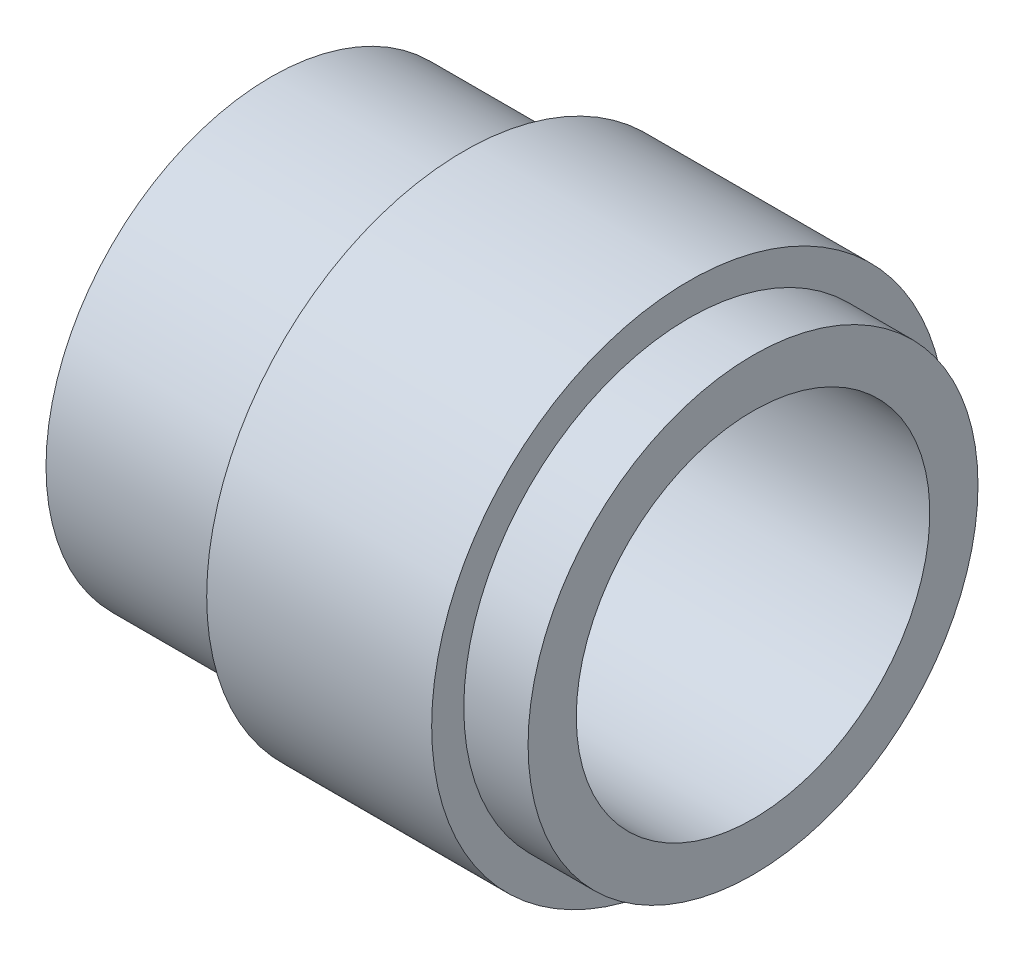
ISO-10303-21;
HEADER;
FILE_DESCRIPTION(('STEP AP214'),'2;1');
FILE_NAME('part.step','',(''),(''),'','','');
FILE_SCHEMA(('AUTOMOTIVE_DESIGN { 1 0 10303 214 1 1 1 1 }'));
ENDSEC;
DATA;
#1=APPLICATION_CONTEXT('core data for automotive mechanical design processes');
#2=APPLICATION_PROTOCOL_DEFINITION('international standard','automotive_design',2000,#1);
#3=PRODUCT_CONTEXT('',#1,'mechanical');
#4=PRODUCT('Part','Part','',(#3));
#5=PRODUCT_RELATED_PRODUCT_CATEGORY('part','',(#4));
#6=PRODUCT_DEFINITION_FORMATION('','',#4);
#7=PRODUCT_DEFINITION_CONTEXT('part definition',#1,'design');
#8=PRODUCT_DEFINITION('design','',#6,#7);
#9=PRODUCT_DEFINITION_SHAPE('','',#8);
#10=(LENGTH_UNIT() NAMED_UNIT(*) SI_UNIT(.MILLI.,.METRE.));
#11=(NAMED_UNIT(*) PLANE_ANGLE_UNIT() SI_UNIT($,.RADIAN.));
#12=(NAMED_UNIT(*) SI_UNIT($,.STERADIAN.) SOLID_ANGLE_UNIT());
#13=UNCERTAINTY_MEASURE_WITH_UNIT(LENGTH_MEASURE(1.E-05),#10,'distance_accuracy_value','');
#14=(GEOMETRIC_REPRESENTATION_CONTEXT(3) GLOBAL_UNCERTAINTY_ASSIGNED_CONTEXT((#13)) GLOBAL_UNIT_ASSIGNED_CONTEXT((#10,
#11,#12)) REPRESENTATION_CONTEXT('',''));
#15=CARTESIAN_POINT('',(0.,0.,0.));
#16=DIRECTION('',(0.,0.,1.));
#17=DIRECTION('',(1.,0.,0.));
#18=AXIS2_PLACEMENT_3D('',#15,#16,#17);
#19=CARTESIAN_POINT('',(-47.5,27.5,0.));
#20=DIRECTION('',(1.,0.,0.));
#21=DIRECTION('',(0.,0.,-1.));
#22=AXIS2_PLACEMENT_3D('',#19,#20,#21);
#23=PLANE('',#22);
#24=CARTESIAN_POINT('',(-47.5,0.,0.));
#25=DIRECTION('',(-1.,0.,0.));
#26=DIRECTION('',(0.,0.,1.));
#27=AXIS2_PLACEMENT_3D('',#24,#25,#26);
#28=CIRCLE('',#27,27.5);
#29=CARTESIAN_POINT('',(-47.5,0.,27.5));
#30=VERTEX_POINT('',#29);
#31=EDGE_CURVE('E60',#30,#30,#28,.T.);
#32=ORIENTED_EDGE('',*,*,#31,.F.);
#33=EDGE_LOOP('',(#32));
#34=FACE_BOUND('',#33,.T.);
#35=CARTESIAN_POINT('',(-47.5,0.,0.));
#36=DIRECTION('',(-1.,0.,0.));
#37=DIRECTION('',(0.,0.,1.));
#38=AXIS2_PLACEMENT_3D('',#35,#36,#37);
#39=CIRCLE('',#38,35.);
#40=CARTESIAN_POINT('',(-47.5,0.,35.));
#41=VERTEX_POINT('',#40);
#42=EDGE_CURVE('E10',#41,#41,#39,.T.);
#43=ORIENTED_EDGE('',*,*,#42,.T.);
#44=EDGE_LOOP('',(#43));
#45=FACE_BOUND('',#44,.T.);
#46=ADVANCED_FACE('F32',(#34,#45),#23,.F.);
#47=CARTESIAN_POINT('',(-25.5,0.,0.));
#48=DIRECTION('',(-1.,0.,0.));
#49=DIRECTION('',(0.,0.,1.));
#50=AXIS2_PLACEMENT_3D('',#47,#48,#49);
#51=CYLINDRICAL_SURFACE('',#50,35.);
#52=ORIENTED_EDGE('',*,*,#42,.F.);
#53=EDGE_LOOP('',(#52));
#54=FACE_BOUND('',#53,.T.);
#55=CARTESIAN_POINT('',(-17.5,0.,0.));
#56=DIRECTION('',(-1.,0.,0.));
#57=DIRECTION('',(0.,0.,1.));
#58=AXIS2_PLACEMENT_3D('',#55,#56,#57);
#59=CIRCLE('',#58,35.);
#60=CARTESIAN_POINT('',(-17.5,0.,35.));
#61=VERTEX_POINT('',#60);
#62=EDGE_CURVE('E38',#61,#61,#59,.T.);
#63=ORIENTED_EDGE('',*,*,#62,.T.);
#64=EDGE_LOOP('',(#63));
#65=FACE_BOUND('',#64,.T.);
#66=ADVANCED_FACE('F67',(#54,#65),#51,.T.);
#67=CARTESIAN_POINT('',(-17.5,35.,0.));
#68=DIRECTION('',(1.,0.,0.));
#69=DIRECTION('',(0.,0.,-1.));
#70=AXIS2_PLACEMENT_3D('',#67,#68,#69);
#71=PLANE('',#70);
#72=ORIENTED_EDGE('',*,*,#62,.F.);
#73=EDGE_LOOP('',(#72));
#74=FACE_BOUND('',#73,.T.);
#75=CARTESIAN_POINT('',(-17.5,0.,0.));
#76=DIRECTION('',(-1.,0.,0.));
#77=DIRECTION('',(0.,0.,1.));
#78=AXIS2_PLACEMENT_3D('',#75,#76,#77);
#79=CIRCLE('',#78,40.);
#80=CARTESIAN_POINT('',(-17.5,0.,40.));
#81=VERTEX_POINT('',#80);
#82=EDGE_CURVE('E42',#81,#81,#79,.T.);
#83=ORIENTED_EDGE('',*,*,#82,.T.);
#84=EDGE_LOOP('',(#83));
#85=FACE_BOUND('',#84,.T.);
#86=ADVANCED_FACE('F71',(#74,#85),#71,.F.);
#87=CARTESIAN_POINT('',(-25.5,0.,0.));
#88=DIRECTION('',(-1.,0.,0.));
#89=DIRECTION('',(0.,0.,1.));
#90=AXIS2_PLACEMENT_3D('',#87,#88,#89);
#91=CYLINDRICAL_SURFACE('',#90,40.);
#92=ORIENTED_EDGE('',*,*,#82,.F.);
#93=EDGE_LOOP('',(#92));
#94=FACE_BOUND('',#93,.T.);
#95=CARTESIAN_POINT('',(17.5,0.,0.));
#96=DIRECTION('',(-1.,0.,0.));
#97=DIRECTION('',(0.,0.,1.));
#98=AXIS2_PLACEMENT_3D('',#95,#96,#97);
#99=CIRCLE('',#98,40.);
#100=CARTESIAN_POINT('',(17.5,0.,40.));
#101=VERTEX_POINT('',#100);
#102=EDGE_CURVE('E46',#101,#101,#99,.T.);
#103=ORIENTED_EDGE('',*,*,#102,.T.);
#104=EDGE_LOOP('',(#103));
#105=FACE_BOUND('',#104,.T.);
#106=ADVANCED_FACE('F76',(#94,#105),#91,.T.);
#107=CARTESIAN_POINT('',(17.5,40.,0.));
#108=DIRECTION('',(-1.,0.,0.));
#109=DIRECTION('',(0.,0.,1.));
#110=AXIS2_PLACEMENT_3D('',#107,#108,#109);
#111=PLANE('',#110);
#112=ORIENTED_EDGE('',*,*,#102,.F.);
#113=EDGE_LOOP('',(#112));
#114=FACE_BOUND('',#113,.T.);
#115=CARTESIAN_POINT('',(17.5,0.,0.));
#116=DIRECTION('',(-1.,0.,0.));
#117=DIRECTION('',(0.,0.,1.));
#118=AXIS2_PLACEMENT_3D('',#115,#116,#117);
#119=CIRCLE('',#118,35.);
#120=CARTESIAN_POINT('',(17.5,0.,35.));
#121=VERTEX_POINT('',#120);
#122=EDGE_CURVE('E51',#121,#121,#119,.T.);
#123=ORIENTED_EDGE('',*,*,#122,.T.);
#124=EDGE_LOOP('',(#123));
#125=FACE_BOUND('',#124,.T.);
#126=ADVANCED_FACE('F82',(#114,#125),#111,.F.);
#127=CARTESIAN_POINT('',(-25.5,0.,0.));
#128=DIRECTION('',(-1.,0.,0.));
#129=DIRECTION('',(0.,0.,1.));
#130=AXIS2_PLACEMENT_3D('',#127,#128,#129);
#131=CYLINDRICAL_SURFACE('',#130,35.);
#132=ORIENTED_EDGE('',*,*,#122,.F.);
#133=EDGE_LOOP('',(#132));
#134=FACE_BOUND('',#133,.T.);
#135=CARTESIAN_POINT('',(27.5,0.,0.));
#136=DIRECTION('',(-1.,0.,0.));
#137=DIRECTION('',(0.,0.,1.));
#138=AXIS2_PLACEMENT_3D('',#135,#136,#137);
#139=CIRCLE('',#138,35.);
#140=CARTESIAN_POINT('',(27.5,0.,35.));
#141=VERTEX_POINT('',#140);
#142=EDGE_CURVE('E54',#141,#141,#139,.T.);
#143=ORIENTED_EDGE('',*,*,#142,.T.);
#144=EDGE_LOOP('',(#143));
#145=FACE_BOUND('',#144,.T.);
#146=ADVANCED_FACE('F86',(#134,#145),#131,.T.);
#147=CARTESIAN_POINT('',(27.5,35.,0.));
#148=DIRECTION('',(-1.,0.,0.));
#149=DIRECTION('',(0.,0.,1.));
#150=AXIS2_PLACEMENT_3D('',#147,#148,#149);
#151=PLANE('',#150);
#152=ORIENTED_EDGE('',*,*,#142,.F.);
#153=EDGE_LOOP('',(#152));
#154=FACE_BOUND('',#153,.T.);
#155=CARTESIAN_POINT('',(27.5,0.,0.));
#156=DIRECTION('',(-1.,0.,0.));
#157=DIRECTION('',(0.,0.,1.));
#158=AXIS2_PLACEMENT_3D('',#155,#156,#157);
#159=CIRCLE('',#158,27.5);
#160=CARTESIAN_POINT('',(27.5,0.,27.5));
#161=VERTEX_POINT('',#160);
#162=EDGE_CURVE('E57',#161,#161,#159,.T.);
#163=ORIENTED_EDGE('',*,*,#162,.T.);
#164=EDGE_LOOP('',(#163));
#165=FACE_BOUND('',#164,.T.);
#166=ADVANCED_FACE('F90',(#154,#165),#151,.F.);
#167=CARTESIAN_POINT('',(-25.5,0.,0.));
#168=DIRECTION('',(-1.,0.,0.));
#169=DIRECTION('',(0.,0.,1.));
#170=AXIS2_PLACEMENT_3D('',#167,#168,#169);
#171=CYLINDRICAL_SURFACE('',#170,27.5);
#172=ORIENTED_EDGE('',*,*,#162,.F.);
#173=EDGE_LOOP('',(#172));
#174=FACE_BOUND('',#173,.T.);
#175=ORIENTED_EDGE('',*,*,#31,.T.);
#176=EDGE_LOOP('',(#175));
#177=FACE_BOUND('',#176,.T.);
#178=ADVANCED_FACE('F64',(#174,#177),#171,.F.);
#179=CLOSED_SHELL('',(#46,#66,#86,#106,#126,#146,#166,#178));
#180=MANIFOLD_SOLID_BREP('B2',#179);
#181=ADVANCED_BREP_SHAPE_REPRESENTATION('',(#18,#180),#14);
#182=SHAPE_DEFINITION_REPRESENTATION(#9,#181);
ENDSEC;
END-ISO-10303-21;
